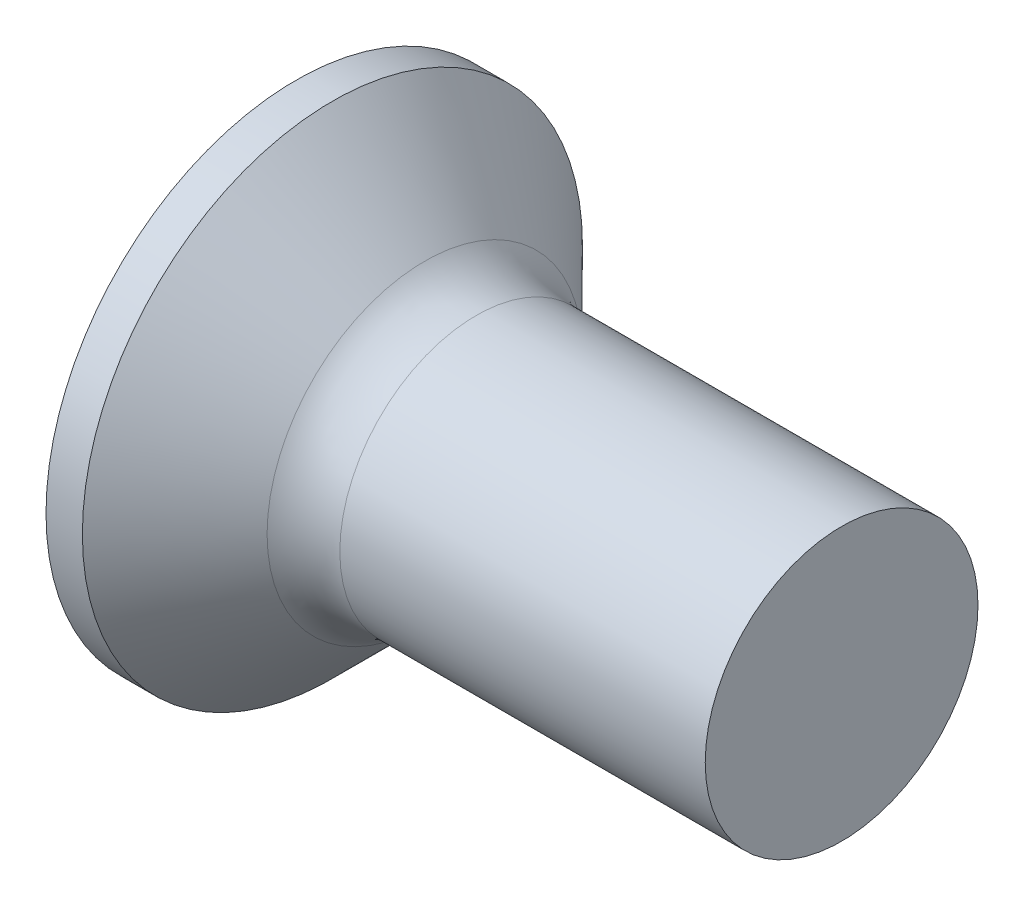
ISO-10303-21;
HEADER;
FILE_DESCRIPTION(('STEP AP214'),'2;1');
FILE_NAME('part.step','',(''),(''),'','','');
FILE_SCHEMA(('AUTOMOTIVE_DESIGN { 1 0 10303 214 1 1 1 1 }'));
ENDSEC;
DATA;
#1=APPLICATION_CONTEXT('core data for automotive mechanical design processes');
#2=APPLICATION_PROTOCOL_DEFINITION('international standard','automotive_design',2000,#1);
#3=PRODUCT_CONTEXT('',#1,'mechanical');
#4=PRODUCT('Part','Part','',(#3));
#5=PRODUCT_RELATED_PRODUCT_CATEGORY('part','',(#4));
#6=PRODUCT_DEFINITION_FORMATION('','',#4);
#7=PRODUCT_DEFINITION_CONTEXT('part definition',#1,'design');
#8=PRODUCT_DEFINITION('design','',#6,#7);
#9=PRODUCT_DEFINITION_SHAPE('','',#8);
#10=(LENGTH_UNIT() NAMED_UNIT(*) SI_UNIT(.MILLI.,.METRE.));
#11=(NAMED_UNIT(*) PLANE_ANGLE_UNIT() SI_UNIT($,.RADIAN.));
#12=(NAMED_UNIT(*) SI_UNIT($,.STERADIAN.) SOLID_ANGLE_UNIT());
#13=UNCERTAINTY_MEASURE_WITH_UNIT(LENGTH_MEASURE(1.E-05),#10,'distance_accuracy_value','');
#14=(GEOMETRIC_REPRESENTATION_CONTEXT(3) GLOBAL_UNCERTAINTY_ASSIGNED_CONTEXT((#13)) GLOBAL_UNIT_ASSIGNED_CONTEXT((#10,
#11,#12)) REPRESENTATION_CONTEXT('',''));
#15=CARTESIAN_POINT('',(0.,0.,0.));
#16=DIRECTION('',(0.,0.,1.));
#17=DIRECTION('',(1.,0.,0.));
#18=AXIS2_PLACEMENT_3D('',#15,#16,#17);
#19=CARTESIAN_POINT('',(2.01,-0.497851135403458,0.37));
#20=DIRECTION('',(0.,0.,-1.));
#21=DIRECTION('',(0.,1.,0.));
#22=AXIS2_PLACEMENT_3D('',#19,#20,#21);
#23=PLANE('',#22);
#24=DIRECTION('',(0.,-1.,0.));
#25=VECTOR('',#24,1.);
#26=CARTESIAN_POINT('',(0.,1.5,0.37));
#27=LINE('',#26,#25);
#28=CARTESIAN_POINT('',(0.,-0.590157547916263,0.37));
#29=VERTEX_POINT('',#28);
#30=CARTESIAN_POINT('',(0.,-1.5,0.37));
#31=VERTEX_POINT('',#30);
#32=EDGE_CURVE('E443',#29,#31,#27,.T.);
#33=ORIENTED_EDGE('',*,*,#32,.F.);
#34=CARTESIAN_POINT('',(-1.01053649691082,-0.672102030072118,0.37));
#35=CARTESIAN_POINT('',(-0.799706058711029,-0.655267098883948,0.37));
#36=CARTESIAN_POINT('',(-0.588886212503304,-0.638297110572312,0.37));
#37=CARTESIAN_POINT('',(-0.16727266252961,-0.603984130519828,0.37));
#38=CARTESIAN_POINT('',(0.0435210406290474,-0.586641131324258,0.37));
#39=CARTESIAN_POINT('',(0.46506883824471,-0.551479911667385,0.37));
#40=CARTESIAN_POINT('',(0.675822932715261,-0.533661691368909,0.37));
#41=CARTESIAN_POINT('',(1.09727362083221,-0.497387538872972,0.37));
#42=CARTESIAN_POINT('',(1.30797021521736,-0.47893161529909,0.37));
#43=CARTESIAN_POINT('',(1.67418894757201,-0.446067164121906,0.37));
#44=CARTESIAN_POINT('',(1.82972932585734,-0.431862501028415,0.37));
#45=CARTESIAN_POINT('',(2.14074770359484,-0.402797709739881,0.37));
#46=CARTESIAN_POINT('',(2.29622570356215,-0.387937587075171,0.37));
#47=CARTESIAN_POINT('',(2.60710169348415,-0.357305117937677,0.37));
#48=CARTESIAN_POINT('',(2.76249967840253,-0.341532719790641,0.37));
#49=CARTESIAN_POINT('',(2.99549070742189,-0.316847908281596,0.37));
#50=CARTESIAN_POINT('',(3.07313791118864,-0.308448465897183,0.37));
#51=CARTESIAN_POINT('',(3.22838341575769,-0.29120225104834,0.37));
#52=CARTESIAN_POINT('',(3.30598171599396,-0.282355473499083,0.37));
#53=CARTESIAN_POINT('',(3.38354828463398,-0.273232461289951,0.37));
#54=B_SPLINE_CURVE_WITH_KNOTS('',3,(#34,#35,#36,#37,#38,#39,#40,#41,#42,#43,#44,#45,#46,#47,#48,
#49,#50,#51,#52,#53),.UNSPECIFIED.,.F.,.F.,(4,2,2,2,2,2,2,2,2,4),(0.,0.634504777554396,
1.26902224766093,1.90353950036111,2.53804817592041,3.00661008438666,3.47516804019383,
3.94375256268972,4.17805198331267,4.41235406779909),.UNSPECIFIED.);
#55=CARTESIAN_POINT('',(2.01,-0.415013252800437,0.37));
#56=VERTEX_POINT('',#55);
#57=EDGE_CURVE('E199',#29,#56,#54,.T.);
#58=ORIENTED_EDGE('',*,*,#57,.T.);
#59=DIRECTION('',(0.,-1.,0.));
#60=VECTOR('',#59,1.);
#61=CARTESIAN_POINT('',(2.01,0.497851135403459,0.37));
#62=LINE('',#61,#60);
#63=CARTESIAN_POINT('',(2.01,-0.497851135403458,0.37));
#64=VERTEX_POINT('',#63);
#65=EDGE_CURVE('E352',#56,#64,#62,.T.);
#66=ORIENTED_EDGE('',*,*,#65,.T.);
#67=DIRECTION('',(0.894934391398442,0.446197753347436,0.));
#68=VECTOR('',#67,1.);
#69=CARTESIAN_POINT('',(0.,-1.5,0.37));
#70=LINE('',#69,#68);
#71=EDGE_CURVE('E451',#31,#64,#70,.T.);
#72=ORIENTED_EDGE('',*,*,#71,.F.);
#73=EDGE_LOOP('',(#33,#58,#66,#72));
#74=FACE_BOUND('',#73,.T.);
#75=ADVANCED_FACE('F17',(#74),#23,.T.);
#76=CARTESIAN_POINT('',(2.01,0.497851135403459,0.37));
#77=VERTEX_POINT('',#76);
#78=CARTESIAN_POINT('',(2.01,0.415013252800437,0.37));
#79=VERTEX_POINT('',#78);
#80=EDGE_CURVE('E348',#77,#79,#62,.T.);
#81=ORIENTED_EDGE('',*,*,#80,.T.);
#82=CARTESIAN_POINT('',(-1.01053649699026,0.672102030078459,0.37));
#83=CARTESIAN_POINT('',(-0.799706058781647,0.655267098889621,0.37));
#84=CARTESIAN_POINT('',(-0.588886212565098,0.63829711057731,0.37));
#85=CARTESIAN_POINT('',(-0.167272662573758,0.603984130523453,0.37));
#86=CARTESIAN_POINT('',(0.0435210405937222,0.586641131327185,0.37));
#87=CARTESIAN_POINT('',(0.465068838236453,0.551479911668094,0.37));
#88=CARTESIAN_POINT('',(0.675822932725247,0.533661691368079,0.37));
#89=CARTESIAN_POINT('',(1.09727362087867,0.497387538868944,0.37));
#90=CARTESIAN_POINT('',(1.30797021528206,0.478931615293404,0.37));
#91=CARTESIAN_POINT('',(1.67418894765493,0.446067164114376,0.37));
#92=CARTESIAN_POINT('',(1.82972932594025,0.431862501020786,0.37));
#93=CARTESIAN_POINT('',(2.14074770367773,0.402797709732016,0.37));
#94=CARTESIAN_POINT('',(2.29622570364503,0.387937587067171,0.37));
#95=CARTESIAN_POINT('',(2.607101693567,0.357305117929347,0.37));
#96=CARTESIAN_POINT('',(2.76249967848536,0.341532719782116,0.37));
#97=CARTESIAN_POINT('',(2.99549070750469,0.316847908272699,0.37));
#98=CARTESIAN_POINT('',(3.07313791127142,0.308448465888149,0.37));
#99=CARTESIAN_POINT('',(3.22838341584044,0.29120225103899,0.37));
#100=CARTESIAN_POINT('',(3.30598171607669,0.282355473489554,0.37));
#101=CARTESIAN_POINT('',(3.38354828471668,0.273232461280216,0.37));
#102=B_SPLINE_CURVE_WITH_KNOTS('',3,(#82,#83,#84,#85,#86,#87,#88,#89,#90,#91,#92,#93,#94,#95,
#96,#97,#98,#99,#100,#101),.UNSPECIFIED.,.F.,.F.,(4,2,2,2,2,2,2,2,2,4),(0.,0.634504777580944,
1.26902224771403,1.90353950046914,2.53804817608336,3.00661008454961,3.47516804035678,
3.94375256285269,4.17805198347564,4.41235406796206),.UNSPECIFIED.);
#103=CARTESIAN_POINT('',(0.,0.590157547916263,0.37));
#104=VERTEX_POINT('',#103);
#105=EDGE_CURVE('E192',#79,#104,#102,.F.);
#106=ORIENTED_EDGE('',*,*,#105,.T.);
#107=CARTESIAN_POINT('',(0.,1.5,0.37));
#108=VERTEX_POINT('',#107);
#109=EDGE_CURVE('E445',#108,#104,#27,.T.);
#110=ORIENTED_EDGE('',*,*,#109,.F.);
#111=DIRECTION('',(0.894934391398442,-0.446197753347436,0.));
#112=VECTOR('',#111,1.);
#113=CARTESIAN_POINT('',(0.,1.5,0.37));
#114=LINE('',#113,#112);
#115=EDGE_CURVE('E40',#108,#77,#114,.T.);
#116=ORIENTED_EDGE('',*,*,#115,.T.);
#117=EDGE_LOOP('',(#81,#106,#110,#116));
#118=FACE_BOUND('',#117,.T.);
#119=ADVANCED_FACE('F173',(#118),#23,.T.);
#120=CARTESIAN_POINT('',(2.01,0.497851135403458,-0.37));
#121=DIRECTION('',(0.,0.,1.));
#122=DIRECTION('',(1.,0.,0.));
#123=AXIS2_PLACEMENT_3D('',#120,#121,#122);
#124=PLANE('',#123);
#125=DIRECTION('',(0.,1.,0.));
#126=VECTOR('',#125,1.);
#127=CARTESIAN_POINT('',(2.01,-0.497851135403458,-0.37));
#128=LINE('',#127,#126);
#129=CARTESIAN_POINT('',(2.01,-0.497851135403458,-0.37));
#130=VERTEX_POINT('',#129);
#131=CARTESIAN_POINT('',(2.01,-0.415013252800437,-0.37));
#132=VERTEX_POINT('',#131);
#133=EDGE_CURVE('E361',#130,#132,#128,.T.);
#134=ORIENTED_EDGE('',*,*,#133,.T.);
#135=CARTESIAN_POINT('',(-1.01053649691082,-0.672102030072118,-0.37));
#136=CARTESIAN_POINT('',(-0.799706058711029,-0.655267098883947,-0.37));
#137=CARTESIAN_POINT('',(-0.588886212503304,-0.638297110572312,-0.37));
#138=CARTESIAN_POINT('',(-0.16727266252961,-0.603984130519828,-0.37));
#139=CARTESIAN_POINT('',(0.0435210406290476,-0.586641131324259,-0.37));
#140=CARTESIAN_POINT('',(0.465068838244709,-0.551479911667386,-0.37));
#141=CARTESIAN_POINT('',(0.675822932715261,-0.53366169136891,-0.37));
#142=CARTESIAN_POINT('',(1.09727362083221,-0.497387538872972,-0.37));
#143=CARTESIAN_POINT('',(1.30797021521736,-0.47893161529909,-0.37));
#144=CARTESIAN_POINT('',(1.67418894757201,-0.446067164121906,-0.37));
#145=CARTESIAN_POINT('',(1.82972932585734,-0.431862501028415,-0.37));
#146=CARTESIAN_POINT('',(2.14074770359484,-0.40279770973988,-0.37));
#147=CARTESIAN_POINT('',(2.29622570356215,-0.387937587075171,-0.37));
#148=CARTESIAN_POINT('',(2.60710169348415,-0.357305117937677,-0.37));
#149=CARTESIAN_POINT('',(2.76249967840254,-0.341532719790641,-0.37));
#150=CARTESIAN_POINT('',(2.9954907074219,-0.316847908281596,-0.37));
#151=CARTESIAN_POINT('',(3.07313791118864,-0.308448465897183,-0.37));
#152=CARTESIAN_POINT('',(3.2283834157577,-0.29120225104834,-0.37));
#153=CARTESIAN_POINT('',(3.30598171599396,-0.282355473499083,-0.37));
#154=CARTESIAN_POINT('',(3.38354828463398,-0.273232461289951,-0.37));
#155=B_SPLINE_CURVE_WITH_KNOTS('',3,(#135,#136,#137,#138,#139,#140,#141,#142,#143,#144,#145,
#146,#147,#148,#149,#150,#151,#152,#153,#154),.UNSPECIFIED.,.F.,.F.,(4,2,2,2,2,2,2,2,2,4),(0.,
0.634504777554396,1.26902224766093,1.90353950036111,2.53804817592041,3.00661008438666,
3.47516804019383,3.94375256268972,4.17805198331268,4.41235406779909),.UNSPECIFIED.);
#156=CARTESIAN_POINT('',(0.,-0.590157547916263,-0.37));
#157=VERTEX_POINT('',#156);
#158=EDGE_CURVE('E255',#132,#157,#155,.F.);
#159=ORIENTED_EDGE('',*,*,#158,.T.);
#160=DIRECTION('',(0.,1.,0.));
#161=VECTOR('',#160,1.);
#162=CARTESIAN_POINT('',(0.,-1.5,-0.37));
#163=LINE('',#162,#161);
#164=CARTESIAN_POINT('',(0.,-1.5,-0.37));
#165=VERTEX_POINT('',#164);
#166=EDGE_CURVE('E444',#165,#157,#163,.T.);
#167=ORIENTED_EDGE('',*,*,#166,.F.);
#168=DIRECTION('',(0.894934391398442,0.446197753347436,0.));
#169=VECTOR('',#168,1.);
#170=CARTESIAN_POINT('',(0.,-1.5,-0.37));
#171=LINE('',#170,#169);
#172=EDGE_CURVE('E454',#165,#130,#171,.T.);
#173=ORIENTED_EDGE('',*,*,#172,.T.);
#174=EDGE_LOOP('',(#134,#159,#167,#173));
#175=FACE_BOUND('',#174,.T.);
#176=ADVANCED_FACE('F180',(#175),#124,.T.);
#177=CARTESIAN_POINT('',(0.,0.590157547916263,-0.37));
#178=VERTEX_POINT('',#177);
#179=CARTESIAN_POINT('',(0.,1.5,-0.37));
#180=VERTEX_POINT('',#179);
#181=EDGE_CURVE('E450',#178,#180,#163,.T.);
#182=ORIENTED_EDGE('',*,*,#181,.F.);
#183=CARTESIAN_POINT('',(-1.01053649691082,0.672102030072118,-0.37));
#184=CARTESIAN_POINT('',(-0.799706058711029,0.655267098883947,-0.37));
#185=CARTESIAN_POINT('',(-0.588886212503304,0.638297110572312,-0.37));
#186=CARTESIAN_POINT('',(-0.16727266252961,0.603984130519828,-0.37));
#187=CARTESIAN_POINT('',(0.0435210406290476,0.586641131324259,-0.37));
#188=CARTESIAN_POINT('',(0.465068838244709,0.551479911667386,-0.37));
#189=CARTESIAN_POINT('',(0.675822932715261,0.53366169136891,-0.37));
#190=CARTESIAN_POINT('',(1.09727362083221,0.497387538872972,-0.37));
#191=CARTESIAN_POINT('',(1.30797021521736,0.47893161529909,-0.37));
#192=CARTESIAN_POINT('',(1.67418894757201,0.446067164121906,-0.37));
#193=CARTESIAN_POINT('',(1.82972932585734,0.431862501028415,-0.37));
#194=CARTESIAN_POINT('',(2.14074770359484,0.40279770973988,-0.37));
#195=CARTESIAN_POINT('',(2.29622570356215,0.387937587075171,-0.37));
#196=CARTESIAN_POINT('',(2.60710169348415,0.357305117937677,-0.37));
#197=CARTESIAN_POINT('',(2.76249967840254,0.341532719790641,-0.37));
#198=CARTESIAN_POINT('',(2.9954907074219,0.316847908281596,-0.37));
#199=CARTESIAN_POINT('',(3.07313791118864,0.308448465897183,-0.37));
#200=CARTESIAN_POINT('',(3.2283834157577,0.29120225104834,-0.37));
#201=CARTESIAN_POINT('',(3.30598171599396,0.282355473499083,-0.37));
#202=CARTESIAN_POINT('',(3.38354828463398,0.273232461289951,-0.37));
#203=B_SPLINE_CURVE_WITH_KNOTS('',3,(#183,#184,#185,#186,#187,#188,#189,#190,#191,#192,#193,
#194,#195,#196,#197,#198,#199,#200,#201,#202),.UNSPECIFIED.,.F.,.F.,(4,2,2,2,2,2,2,2,2,4),(0.,
0.634504777554396,1.26902224766093,1.90353950036111,2.53804817592041,3.00661008438666,
3.47516804019383,3.94375256268972,4.17805198331268,4.41235406779909),.UNSPECIFIED.);
#204=CARTESIAN_POINT('',(2.01,0.415013252800437,-0.37));
#205=VERTEX_POINT('',#204);
#206=EDGE_CURVE('E249',#178,#205,#203,.T.);
#207=ORIENTED_EDGE('',*,*,#206,.T.);
#208=CARTESIAN_POINT('',(2.01,0.497851135403459,-0.37));
#209=VERTEX_POINT('',#208);
#210=EDGE_CURVE('E363',#205,#209,#128,.T.);
#211=ORIENTED_EDGE('',*,*,#210,.T.);
#212=DIRECTION('',(0.894934391398442,-0.446197753347436,0.));
#213=VECTOR('',#212,1.);
#214=CARTESIAN_POINT('',(0.,1.5,-0.37));
#215=LINE('',#214,#213);
#216=EDGE_CURVE('E360',#180,#209,#215,.T.);
#217=ORIENTED_EDGE('',*,*,#216,.F.);
#218=EDGE_LOOP('',(#182,#207,#211,#217));
#219=FACE_BOUND('',#218,.T.);
#220=ADVANCED_FACE('F461',(#219),#124,.T.);
#221=CARTESIAN_POINT('',(2.01,0.497851135403459,-0.37));
#222=DIRECTION('',(1.,0.,0.));
#223=DIRECTION('',(0.,0.,-1.));
#224=AXIS2_PLACEMENT_3D('',#221,#222,#223);
#225=PLANE('',#224);
#226=CARTESIAN_POINT('',(2.01,0.,0.));
#227=DIRECTION('',(-1.,0.,0.));
#228=DIRECTION('',(0.,0.,1.));
#229=AXIS2_PLACEMENT_3D('',#226,#227,#228);
#230=CIRCLE('',#229,0.556);
#231=CARTESIAN_POINT('',(2.01,-0.247548473995471,-0.497851135403459));
#232=VERTEX_POINT('',#231);
#233=CARTESIAN_POINT('',(2.01,-0.37,-0.415013252800438));
#234=VERTEX_POINT('',#233);
#235=EDGE_CURVE('E327',#232,#234,#230,.T.);
#236=ORIENTED_EDGE('',*,*,#235,.F.);
#237=DIRECTION('',(0.,1.,0.));
#238=VECTOR('',#237,1.);
#239=CARTESIAN_POINT('',(2.01,-0.37,-0.49785113540346));
#240=LINE('',#239,#238);
#241=CARTESIAN_POINT('',(2.01,-0.37,-0.49785113540346));
#242=VERTEX_POINT('',#241);
#243=EDGE_CURVE('E428',#242,#232,#240,.T.);
#244=ORIENTED_EDGE('',*,*,#243,.F.);
#245=DIRECTION('',(0.,0.,-1.));
#246=VECTOR('',#245,1.);
#247=CARTESIAN_POINT('',(2.01,-0.37,0.497851135403457));
#248=LINE('',#247,#246);
#249=EDGE_CURVE('E432',#234,#242,#248,.T.);
#250=ORIENTED_EDGE('',*,*,#249,.F.);
#251=EDGE_LOOP('',(#236,#244,#250));
#252=FACE_BOUND('',#251,.T.);
#253=ADVANCED_FACE('F475',(#252),#225,.F.);
#254=CARTESIAN_POINT('',(2.01,-0.497851135403458,-0.247548473995472));
#255=VERTEX_POINT('',#254);
#256=EDGE_CURVE('E322',#132,#255,#230,.T.);
#257=ORIENTED_EDGE('',*,*,#256,.F.);
#258=ORIENTED_EDGE('',*,*,#133,.F.);
#259=DIRECTION('',(0.,0.,-1.));
#260=VECTOR('',#259,1.);
#261=CARTESIAN_POINT('',(2.01,-0.497851135403458,0.37));
#262=LINE('',#261,#260);
#263=EDGE_CURVE('E351',#255,#130,#262,.T.);
#264=ORIENTED_EDGE('',*,*,#263,.F.);
#265=EDGE_LOOP('',(#257,#258,#264));
#266=FACE_BOUND('',#265,.T.);
#267=ADVANCED_FACE('F482',(#266),#225,.F.);
#268=CARTESIAN_POINT('',(2.01,-0.497851135403458,0.247548473995472));
#269=VERTEX_POINT('',#268);
#270=EDGE_CURVE('E317',#269,#56,#230,.T.);
#271=ORIENTED_EDGE('',*,*,#270,.F.);
#272=EDGE_CURVE('E354',#64,#269,#262,.T.);
#273=ORIENTED_EDGE('',*,*,#272,.F.);
#274=ORIENTED_EDGE('',*,*,#65,.F.);
#275=EDGE_LOOP('',(#271,#273,#274));
#276=FACE_BOUND('',#275,.T.);
#277=ADVANCED_FACE('F489',(#276),#225,.F.);
#278=CARTESIAN_POINT('',(2.01,-0.37,0.415013252800436));
#279=VERTEX_POINT('',#278);
#280=CARTESIAN_POINT('',(2.01,-0.247548473995474,0.497851135403458));
#281=VERTEX_POINT('',#280);
#282=EDGE_CURVE('E32',#279,#281,#230,.T.);
#283=ORIENTED_EDGE('',*,*,#282,.F.);
#284=CARTESIAN_POINT('',(2.01,-0.37,0.497851135403457));
#285=VERTEX_POINT('',#284);
#286=EDGE_CURVE('E434',#285,#279,#248,.T.);
#287=ORIENTED_EDGE('',*,*,#286,.F.);
#288=DIRECTION('',(0.,-1.,0.));
#289=VECTOR('',#288,1.);
#290=CARTESIAN_POINT('',(2.01,0.37,0.49785113540346));
#291=LINE('',#290,#289);
#292=EDGE_CURVE('E433',#281,#285,#291,.T.);
#293=ORIENTED_EDGE('',*,*,#292,.F.);
#294=EDGE_LOOP('',(#283,#287,#293));
#295=FACE_BOUND('',#294,.T.);
#296=ADVANCED_FACE('F518',(#295),#225,.F.);
#297=CARTESIAN_POINT('',(2.01,0.24754847399547,0.497851135403459));
#298=VERTEX_POINT('',#297);
#299=CARTESIAN_POINT('',(2.01,0.37,0.415013252800438));
#300=VERTEX_POINT('',#299);
#301=EDGE_CURVE('E308',#298,#300,#230,.T.);
#302=ORIENTED_EDGE('',*,*,#301,.F.);
#303=CARTESIAN_POINT('',(2.01,0.37,0.49785113540346));
#304=VERTEX_POINT('',#303);
#305=EDGE_CURVE('E429',#304,#298,#291,.T.);
#306=ORIENTED_EDGE('',*,*,#305,.F.);
#307=DIRECTION('',(0.,0.,1.));
#308=VECTOR('',#307,1.);
#309=CARTESIAN_POINT('',(2.01,0.37,-0.497851135403457));
#310=LINE('',#309,#308);
#311=EDGE_CURVE('E206',#300,#304,#310,.T.);
#312=ORIENTED_EDGE('',*,*,#311,.F.);
#313=EDGE_LOOP('',(#302,#306,#312));
#314=FACE_BOUND('',#313,.T.);
#315=ADVANCED_FACE('F471',(#314),#225,.F.);
#316=CARTESIAN_POINT('',(2.01,0.497851135403459,0.247548473995472));
#317=VERTEX_POINT('',#316);
#318=EDGE_CURVE('E315',#79,#317,#230,.T.);
#319=ORIENTED_EDGE('',*,*,#318,.F.);
#320=ORIENTED_EDGE('',*,*,#80,.F.);
#321=DIRECTION('',(0.,0.,1.));
#322=VECTOR('',#321,1.);
#323=CARTESIAN_POINT('',(2.01,0.497851135403459,-0.37));
#324=LINE('',#323,#322);
#325=EDGE_CURVE('E349',#317,#77,#324,.T.);
#326=ORIENTED_EDGE('',*,*,#325,.F.);
#327=EDGE_LOOP('',(#319,#320,#326));
#328=FACE_BOUND('',#327,.T.);
#329=ADVANCED_FACE('F347',(#328),#225,.F.);
#330=CARTESIAN_POINT('',(2.01,0.497851135403459,-0.247548473995472));
#331=VERTEX_POINT('',#330);
#332=EDGE_CURVE('E337',#331,#205,#230,.T.);
#333=ORIENTED_EDGE('',*,*,#332,.F.);
#334=EDGE_CURVE('E356',#209,#331,#324,.T.);
#335=ORIENTED_EDGE('',*,*,#334,.F.);
#336=ORIENTED_EDGE('',*,*,#210,.F.);
#337=EDGE_LOOP('',(#333,#335,#336));
#338=FACE_BOUND('',#337,.T.);
#339=ADVANCED_FACE('F463',(#338),#225,.F.);
#340=CARTESIAN_POINT('',(2.01,-0.497851135403458,-0.37));
#341=DIRECTION('',(-0.446197753347436,0.894934391398443,0.));
#342=DIRECTION('',(-0.894934391398442,-0.446197753347436,0.));
#343=AXIS2_PLACEMENT_3D('',#340,#341,#342);
#344=PLANE('',#343);
#345=ORIENTED_EDGE('',*,*,#272,.T.);
#346=CARTESIAN_POINT('',(2.86902919914418,-0.0695550475538963,0.));
#347=DIRECTION('',(-0.446197753347436,0.894934391398443,0.));
#348=DIRECTION('',(-0.894934391398443,-0.446197753347436,0.));
#349=AXIS2_PLACEMENT_3D('',#346,#347,#348);
#350=ELLIPSE('',#349,1.11145971268776,0.491029001453358);
#351=EDGE_CURVE('E267',#269,#255,#350,.F.);
#352=ORIENTED_EDGE('',*,*,#351,.T.);
#353=ORIENTED_EDGE('',*,*,#263,.T.);
#354=ORIENTED_EDGE('',*,*,#172,.F.);
#355=DIRECTION('',(0.,0.,-1.));
#356=VECTOR('',#355,1.);
#357=CARTESIAN_POINT('',(0.,-1.5,0.37));
#358=LINE('',#357,#356);
#359=EDGE_CURVE('E368',#31,#165,#358,.T.);
#360=ORIENTED_EDGE('',*,*,#359,.F.);
#361=ORIENTED_EDGE('',*,*,#71,.T.);
#362=EDGE_LOOP('',(#345,#352,#353,#354,#360,#361));
#363=FACE_BOUND('',#362,.T.);
#364=ADVANCED_FACE('F186',(#363),#344,.T.);
#365=CARTESIAN_POINT('',(2.01,0.497851135403459,0.37));
#366=DIRECTION('',(-0.446197753347436,-0.894934391398443,0.));
#367=DIRECTION('',(0.894934391398442,-0.446197753347436,0.));
#368=AXIS2_PLACEMENT_3D('',#365,#366,#367);
#369=PLANE('',#368);
#370=ORIENTED_EDGE('',*,*,#334,.T.);
#371=CARTESIAN_POINT('',(2.86902919914418,0.0695550475538964,0.));
#372=DIRECTION('',(-0.446197753347436,-0.894934391398443,0.));
#373=DIRECTION('',(-0.894934391398443,0.446197753347436,0.));
#374=AXIS2_PLACEMENT_3D('',#371,#372,#373);
#375=ELLIPSE('',#374,1.11145971268776,0.491029001453358);
#376=EDGE_CURVE('E272',#331,#317,#375,.F.);
#377=ORIENTED_EDGE('',*,*,#376,.T.);
#378=ORIENTED_EDGE('',*,*,#325,.T.);
#379=ORIENTED_EDGE('',*,*,#115,.F.);
#380=DIRECTION('',(0.,0.,1.));
#381=VECTOR('',#380,1.);
#382=CARTESIAN_POINT('',(0.,1.5,-0.37));
#383=LINE('',#382,#381);
#384=EDGE_CURVE('E440',#180,#108,#383,.T.);
#385=ORIENTED_EDGE('',*,*,#384,.F.);
#386=ORIENTED_EDGE('',*,*,#216,.T.);
#387=EDGE_LOOP('',(#370,#377,#378,#379,#385,#386));
#388=FACE_BOUND('',#387,.T.);
#389=ADVANCED_FACE('F459',(#388),#369,.T.);
#390=CARTESIAN_POINT('',(2.01,0.37,0.49785113540346));
#391=DIRECTION('',(0.,-1.,0.));
#392=DIRECTION('',(1.,0.,0.));
#393=AXIS2_PLACEMENT_3D('',#390,#391,#392);
#394=PLANE('',#393);
#395=CARTESIAN_POINT('',(2.01,0.37,-0.497851135403457));
#396=VERTEX_POINT('',#395);
#397=CARTESIAN_POINT('',(2.01,0.37,-0.415013252800436));
#398=VERTEX_POINT('',#397);
#399=EDGE_CURVE('E438',#396,#398,#310,.T.);
#400=ORIENTED_EDGE('',*,*,#399,.T.);
#401=CARTESIAN_POINT('',(-1.01053649699026,0.37,-0.672102030078458));
#402=CARTESIAN_POINT('',(-0.799706058781647,0.370000000000005,-0.655267098889618));
#403=CARTESIAN_POINT('',(-0.588886212565098,0.370000000000005,-0.638297110577307));
#404=CARTESIAN_POINT('',(-0.167272662573759,0.370000000000002,-0.603984130523451));
#405=CARTESIAN_POINT('',(0.0435210405937217,0.37,-0.586641131327184));
#406=CARTESIAN_POINT('',(0.465068838236452,0.37,-0.551479911668093));
#407=CARTESIAN_POINT('',(0.675822932725247,0.370000000000004,-0.533661691368076));
#408=CARTESIAN_POINT('',(1.09727362087867,0.370000000000003,-0.497387538868941));
#409=CARTESIAN_POINT('',(1.30797021528206,0.37,-0.478931615293403));
#410=CARTESIAN_POINT('',(1.67418894765493,0.37,-0.446067164114375));
#411=CARTESIAN_POINT('',(1.82972932594025,0.370000000000002,-0.431862501020783));
#412=CARTESIAN_POINT('',(2.14074770367772,0.370000000000004,-0.402797709732013));
#413=CARTESIAN_POINT('',(2.29622570364503,0.370000000000003,-0.387937587067168));
#414=CARTESIAN_POINT('',(2.607101693567,0.370000000000003,-0.357305117929344));
#415=CARTESIAN_POINT('',(2.76249967848536,0.370000000000003,-0.341532719782113));
#416=CARTESIAN_POINT('',(2.99549070750469,0.370000000000003,-0.316847908272695));
#417=CARTESIAN_POINT('',(3.07313791127142,0.370000000000003,-0.308448465888145));
#418=CARTESIAN_POINT('',(3.22838341584044,0.370000000000003,-0.291202251038987));
#419=CARTESIAN_POINT('',(3.30598171607669,0.370000000000002,-0.282355473489552));
#420=CARTESIAN_POINT('',(3.38354828471668,0.37,-0.273232461280215));
#421=B_SPLINE_CURVE_WITH_KNOTS('',3,(#401,#402,#403,#404,#405,#406,#407,#408,#409,#410,#411,
#412,#413,#414,#415,#416,#417,#418,#419,#420),.UNSPECIFIED.,.F.,.F.,(4,2,2,2,2,2,2,2,2,4),(0.,
0.634504777580944,1.26902224771403,1.90353950046914,2.53804817608336,3.00661008454961,
3.47516804035678,3.94375256285269,4.17805198347564,4.41235406796206),.UNSPECIFIED.);
#422=CARTESIAN_POINT('',(0.,0.37,-0.590157547916262));
#423=VERTEX_POINT('',#422);
#424=EDGE_CURVE('E241',#398,#423,#421,.F.);
#425=ORIENTED_EDGE('',*,*,#424,.T.);
#426=DIRECTION('',(0.,0.,1.));
#427=VECTOR('',#426,1.);
#428=CARTESIAN_POINT('',(0.,0.370000000000005,-1.5));
#429=LINE('',#428,#427);
#430=CARTESIAN_POINT('',(0.,0.370000000000005,-1.5));
#431=VERTEX_POINT('',#430);
#432=EDGE_CURVE('E414',#431,#423,#429,.T.);
#433=ORIENTED_EDGE('',*,*,#432,.F.);
#434=DIRECTION('',(0.894934391398442,0.,0.446197753347436));
#435=VECTOR('',#434,1.);
#436=CARTESIAN_POINT('',(0.,0.370000000000005,-1.5));
#437=LINE('',#436,#435);
#438=EDGE_CURVE('E420',#431,#396,#437,.T.);
#439=ORIENTED_EDGE('',*,*,#438,.T.);
#440=EDGE_LOOP('',(#400,#425,#433,#439));
#441=FACE_BOUND('',#440,.T.);
#442=ADVANCED_FACE('F598',(#441),#394,.T.);
#443=CARTESIAN_POINT('',(2.01,-0.37,-0.497851135403459));
#444=DIRECTION('',(0.,1.,0.));
#445=DIRECTION('',(0.,0.,1.));
#446=AXIS2_PLACEMENT_3D('',#443,#444,#445);
#447=PLANE('',#446);
#448=DIRECTION('',(0.,0.,-1.));
#449=VECTOR('',#448,1.);
#450=CARTESIAN_POINT('',(0.,-0.370000000000005,1.5));
#451=LINE('',#450,#449);
#452=CARTESIAN_POINT('',(0.,-0.37,-0.590157547916264));
#453=VERTEX_POINT('',#452);
#454=CARTESIAN_POINT('',(0.,-0.369999999999995,-1.5));
#455=VERTEX_POINT('',#454);
#456=EDGE_CURVE('E410',#453,#455,#451,.T.);
#457=ORIENTED_EDGE('',*,*,#456,.F.);
#458=CARTESIAN_POINT('',(-1.01053649699026,-0.37,-0.67210203007846));
#459=CARTESIAN_POINT('',(-0.799706058781647,-0.369999999999999,-0.655267098889621));
#460=CARTESIAN_POINT('',(-0.588886212565098,-0.369999999999999,-0.63829711057731));
#461=CARTESIAN_POINT('',(-0.167272662573758,-0.37,-0.603984130523453));
#462=CARTESIAN_POINT('',(0.0435210405937221,-0.37,-0.586641131327186));
#463=CARTESIAN_POINT('',(0.465068838236453,-0.37,-0.551479911668095));
#464=CARTESIAN_POINT('',(0.675822932725247,-0.37,-0.533661691368079));
#465=CARTESIAN_POINT('',(1.09727362087867,-0.37,-0.497387538868944));
#466=CARTESIAN_POINT('',(1.30797021528206,-0.37,-0.478931615293406));
#467=CARTESIAN_POINT('',(1.67418894765493,-0.37,-0.446067164114378));
#468=CARTESIAN_POINT('',(1.82972932594025,-0.37,-0.431862501020786));
#469=CARTESIAN_POINT('',(2.14074770367772,-0.37,-0.402797709732016));
#470=CARTESIAN_POINT('',(2.29622570364503,-0.37,-0.38793758706717));
#471=CARTESIAN_POINT('',(2.60710169356699,-0.37,-0.357305117929347));
#472=CARTESIAN_POINT('',(2.76249967848536,-0.37,-0.341532719782116));
#473=CARTESIAN_POINT('',(2.99549070750469,-0.370000000000001,-0.316847908272698));
#474=CARTESIAN_POINT('',(3.07313791127142,-0.370000000000001,-0.308448465888148));
#475=CARTESIAN_POINT('',(3.22838341584044,-0.370000000000001,-0.291202251038989));
#476=CARTESIAN_POINT('',(3.30598171607669,-0.37,-0.282355473489554));
#477=CARTESIAN_POINT('',(3.38354828471668,-0.37,-0.273232461280217));
#478=B_SPLINE_CURVE_WITH_KNOTS('',3,(#458,#459,#460,#461,#462,#463,#464,#465,#466,#467,#468,
#469,#470,#471,#472,#473,#474,#475,#476,#477),.UNSPECIFIED.,.F.,.F.,(4,2,2,2,2,2,2,2,2,4),(0.,
0.634504777580944,1.26902224771403,1.90353950046914,2.53804817608336,3.00661008454961,
3.47516804035678,3.94375256285268,4.17805198347564,4.41235406796206),.UNSPECIFIED.);
#479=EDGE_CURVE('E234',#453,#234,#478,.T.);
#480=ORIENTED_EDGE('',*,*,#479,.T.);
#481=ORIENTED_EDGE('',*,*,#249,.T.);
#482=DIRECTION('',(0.894934391398442,0.,0.446197753347436));
#483=VECTOR('',#482,1.);
#484=CARTESIAN_POINT('',(0.,-0.369999999999995,-1.5));
#485=LINE('',#484,#483);
#486=EDGE_CURVE('E417',#455,#242,#485,.T.);
#487=ORIENTED_EDGE('',*,*,#486,.F.);
#488=EDGE_LOOP('',(#457,#480,#481,#487));
#489=FACE_BOUND('',#488,.T.);
#490=ADVANCED_FACE('F494',(#489),#447,.T.);
#491=CARTESIAN_POINT('',(2.01,0.37,-0.497851135403457));
#492=DIRECTION('',(-0.446197753347436,0.,0.894934391398443));
#493=DIRECTION('',(-0.894934391398442,0.,-0.446197753347436));
#494=AXIS2_PLACEMENT_3D('',#491,#492,#493);
#495=PLANE('',#494);
#496=ORIENTED_EDGE('',*,*,#243,.T.);
#497=CARTESIAN_POINT('',(2.86902919914418,0.,-0.0695550475538964));
#498=DIRECTION('',(-0.446197753347436,0.,0.894934391398443));
#499=DIRECTION('',(-0.894934391398443,0.,-0.446197753347436));
#500=AXIS2_PLACEMENT_3D('',#497,#498,#499);
#501=ELLIPSE('',#500,1.11145971268776,0.491029001453358);
#502=CARTESIAN_POINT('',(2.01,0.247548473995474,-0.497851135403457));
#503=VERTEX_POINT('',#502);
#504=EDGE_CURVE('E285',#232,#503,#501,.F.);
#505=ORIENTED_EDGE('',*,*,#504,.T.);
#506=EDGE_CURVE('E436',#503,#396,#240,.T.);
#507=ORIENTED_EDGE('',*,*,#506,.T.);
#508=ORIENTED_EDGE('',*,*,#438,.F.);
#509=DIRECTION('',(0.,1.,0.));
#510=VECTOR('',#509,1.);
#511=CARTESIAN_POINT('',(0.,-0.369999999999995,-1.5));
#512=LINE('',#511,#510);
#513=EDGE_CURVE('E409',#455,#431,#512,.T.);
#514=ORIENTED_EDGE('',*,*,#513,.F.);
#515=ORIENTED_EDGE('',*,*,#486,.T.);
#516=EDGE_LOOP('',(#496,#505,#507,#508,#514,#515));
#517=FACE_BOUND('',#516,.T.);
#518=ADVANCED_FACE('F211',(#517),#495,.T.);
#519=ORIENTED_EDGE('',*,*,#286,.T.);
#520=CARTESIAN_POINT('',(-1.01053649699026,-0.37,0.672102030078458));
#521=CARTESIAN_POINT('',(-0.799706058781647,-0.370000000000005,0.655267098889618));
#522=CARTESIAN_POINT('',(-0.588886212565098,-0.370000000000005,0.638297110577307));
#523=CARTESIAN_POINT('',(-0.167272662573759,-0.370000000000002,0.603984130523451));
#524=CARTESIAN_POINT('',(0.0435210405937217,-0.37,0.586641131327184));
#525=CARTESIAN_POINT('',(0.465068838236452,-0.37,0.551479911668093));
#526=CARTESIAN_POINT('',(0.675822932725247,-0.370000000000003,0.533661691368076));
#527=CARTESIAN_POINT('',(1.09727362087867,-0.370000000000003,0.497387538868941));
#528=CARTESIAN_POINT('',(1.30797021528206,-0.37,0.478931615293403));
#529=CARTESIAN_POINT('',(1.67418894765493,-0.37,0.446067164114375));
#530=CARTESIAN_POINT('',(1.82972932594025,-0.370000000000002,0.431862501020783));
#531=CARTESIAN_POINT('',(2.14074770367772,-0.370000000000004,0.402797709732013));
#532=CARTESIAN_POINT('',(2.29622570364503,-0.370000000000003,0.387937587067168));
#533=CARTESIAN_POINT('',(2.607101693567,-0.370000000000003,0.357305117929344));
#534=CARTESIAN_POINT('',(2.76249967848536,-0.370000000000003,0.341532719782113));
#535=CARTESIAN_POINT('',(2.99549070750469,-0.370000000000003,0.316847908272696));
#536=CARTESIAN_POINT('',(3.07313791127142,-0.370000000000003,0.308448465888146));
#537=CARTESIAN_POINT('',(3.22838341584044,-0.370000000000002,0.291202251038987));
#538=CARTESIAN_POINT('',(3.30598171607669,-0.370000000000002,0.282355473489552));
#539=CARTESIAN_POINT('',(3.38354828471668,-0.37,0.273232461280215));
#540=B_SPLINE_CURVE_WITH_KNOTS('',3,(#520,#521,#522,#523,#524,#525,#526,#527,#528,#529,#530,
#531,#532,#533,#534,#535,#536,#537,#538,#539),.UNSPECIFIED.,.F.,.F.,(4,2,2,2,2,2,2,2,2,4),(0.,
0.634504777580944,1.26902224771403,1.90353950046914,2.53804817608336,3.00661008454961,
3.47516804035678,3.94375256285269,4.17805198347564,4.41235406796206),.UNSPECIFIED.);
#541=CARTESIAN_POINT('',(0.,-0.37,0.590157547916262));
#542=VERTEX_POINT('',#541);
#543=EDGE_CURVE('E226',#279,#542,#540,.F.);
#544=ORIENTED_EDGE('',*,*,#543,.T.);
#545=CARTESIAN_POINT('',(0.,-0.370000000000005,1.5));
#546=VERTEX_POINT('',#545);
#547=EDGE_CURVE('E405',#546,#542,#451,.T.);
#548=ORIENTED_EDGE('',*,*,#547,.F.);
#549=DIRECTION('',(0.894934391398442,0.,-0.446197753347436));
#550=VECTOR('',#549,1.);
#551=CARTESIAN_POINT('',(0.,-0.370000000000005,1.5));
#552=LINE('',#551,#550);
#553=EDGE_CURVE('E423',#546,#285,#552,.T.);
#554=ORIENTED_EDGE('',*,*,#553,.T.);
#555=EDGE_LOOP('',(#519,#544,#548,#554));
#556=FACE_BOUND('',#555,.T.);
#557=ADVANCED_FACE('F516',(#556),#447,.T.);
#558=CARTESIAN_POINT('',(0.,0.37,0.590157547916264));
#559=VERTEX_POINT('',#558);
#560=CARTESIAN_POINT('',(0.,0.369999999999994,1.5));
#561=VERTEX_POINT('',#560);
#562=EDGE_CURVE('E416',#559,#561,#429,.T.);
#563=ORIENTED_EDGE('',*,*,#562,.F.);
#564=CARTESIAN_POINT('',(-1.01053649699026,0.37,0.67210203007846));
#565=CARTESIAN_POINT('',(-0.799706058781647,0.369999999999999,0.65526709888962));
#566=CARTESIAN_POINT('',(-0.588886212565098,0.369999999999999,0.63829711057731));
#567=CARTESIAN_POINT('',(-0.167272662573758,0.37,0.603984130523454));
#568=CARTESIAN_POINT('',(0.0435210405937222,0.37,0.586641131327187));
#569=CARTESIAN_POINT('',(0.465068838236453,0.37,0.551479911668096));
#570=CARTESIAN_POINT('',(0.675822932725248,0.37,0.533661691368079));
#571=CARTESIAN_POINT('',(1.09727362087867,0.37,0.497387538868944));
#572=CARTESIAN_POINT('',(1.30797021528206,0.37,0.478931615293406));
#573=CARTESIAN_POINT('',(1.67418894765493,0.37,0.446067164114378));
#574=CARTESIAN_POINT('',(1.82972932594025,0.37,0.431862501020786));
#575=CARTESIAN_POINT('',(2.14074770367772,0.37,0.402797709732015));
#576=CARTESIAN_POINT('',(2.29622570364503,0.37,0.38793758706717));
#577=CARTESIAN_POINT('',(2.60710169356699,0.370000000000001,0.357305117929347));
#578=CARTESIAN_POINT('',(2.76249967848536,0.370000000000001,0.341532719782116));
#579=CARTESIAN_POINT('',(2.99549070750469,0.370000000000001,0.316847908272698));
#580=CARTESIAN_POINT('',(3.07313791127142,0.370000000000001,0.308448465888148));
#581=CARTESIAN_POINT('',(3.22838341584044,0.370000000000001,0.291202251038989));
#582=CARTESIAN_POINT('',(3.30598171607669,0.370000000000001,0.282355473489554));
#583=CARTESIAN_POINT('',(3.38354828471668,0.37,0.273232461280217));
#584=B_SPLINE_CURVE_WITH_KNOTS('',3,(#564,#565,#566,#567,#568,#569,#570,#571,#572,#573,#574,
#575,#576,#577,#578,#579,#580,#581,#582,#583),.UNSPECIFIED.,.F.,.F.,(4,2,2,2,2,2,2,2,2,4),(0.,
0.634504777580944,1.26902224771403,1.90353950046914,2.53804817608336,3.00661008454961,
3.47516804035678,3.94375256285268,4.17805198347564,4.41235406796206),.UNSPECIFIED.);
#585=EDGE_CURVE('E216',#559,#300,#584,.T.);
#586=ORIENTED_EDGE('',*,*,#585,.T.);
#587=ORIENTED_EDGE('',*,*,#311,.T.);
#588=DIRECTION('',(0.894934391398442,0.,-0.446197753347436));
#589=VECTOR('',#588,1.);
#590=CARTESIAN_POINT('',(0.,0.369999999999994,1.5));
#591=LINE('',#590,#589);
#592=EDGE_CURVE('E425',#561,#304,#591,.T.);
#593=ORIENTED_EDGE('',*,*,#592,.F.);
#594=EDGE_LOOP('',(#563,#586,#587,#593));
#595=FACE_BOUND('',#594,.T.);
#596=ADVANCED_FACE('F511',(#595),#394,.T.);
#597=CARTESIAN_POINT('',(2.01,-0.37,0.497851135403457));
#598=DIRECTION('',(-0.446197753347436,0.,-0.894934391398443));
#599=DIRECTION('',(0.894934391398442,0.,-0.446197753347436));
#600=AXIS2_PLACEMENT_3D('',#597,#598,#599);
#601=PLANE('',#600);
#602=ORIENTED_EDGE('',*,*,#305,.T.);
#603=CARTESIAN_POINT('',(2.86902919914418,0.,0.0695550475538964));
#604=DIRECTION('',(-0.446197753347436,0.,-0.894934391398443));
#605=DIRECTION('',(-0.894934391398443,0.,0.446197753347436));
#606=AXIS2_PLACEMENT_3D('',#603,#604,#605);
#607=ELLIPSE('',#606,1.11145971268776,0.491029001453358);
#608=EDGE_CURVE('E11',#298,#281,#607,.F.);
#609=ORIENTED_EDGE('',*,*,#608,.T.);
#610=ORIENTED_EDGE('',*,*,#292,.T.);
#611=ORIENTED_EDGE('',*,*,#553,.F.);
#612=DIRECTION('',(0.,-1.,0.));
#613=VECTOR('',#612,1.);
#614=CARTESIAN_POINT('',(0.,0.369999999999994,1.5));
#615=LINE('',#614,#613);
#616=EDGE_CURVE('E207',#561,#546,#615,.T.);
#617=ORIENTED_EDGE('',*,*,#616,.F.);
#618=ORIENTED_EDGE('',*,*,#592,.T.);
#619=EDGE_LOOP('',(#602,#609,#610,#611,#617,#618));
#620=FACE_BOUND('',#619,.T.);
#621=ADVANCED_FACE('F403',(#620),#601,.T.);
#622=CARTESIAN_POINT('',(0.,0.,0.));
#623=DIRECTION('',(-1.,0.,0.));
#624=DIRECTION('',(0.,0.,1.));
#625=AXIS2_PLACEMENT_3D('',#622,#623,#624);
#626=PLANE('',#625);
#627=CARTESIAN_POINT('',(0.,0.,0.));
#628=DIRECTION('',(-1.,0.,0.));
#629=DIRECTION('',(0.,0.,1.));
#630=AXIS2_PLACEMENT_3D('',#627,#628,#629);
#631=CIRCLE('',#630,2.75);
#632=CARTESIAN_POINT('',(0.,0.,2.75));
#633=VERTEX_POINT('',#632);
#634=EDGE_CURVE('E371',#633,#633,#631,.T.);
#635=ORIENTED_EDGE('',*,*,#634,.T.);
#636=EDGE_LOOP('',(#635));
#637=FACE_BOUND('',#636,.T.);
#638=ORIENTED_EDGE('',*,*,#547,.T.);
#639=CARTESIAN_POINT('',(0.,0.,0.));
#640=DIRECTION('',(-1.,0.,0.));
#641=DIRECTION('',(0.,0.,1.));
#642=AXIS2_PLACEMENT_3D('',#639,#640,#641);
#643=CIRCLE('',#642,0.696552892006441);
#644=EDGE_CURVE('E303',#29,#542,#643,.T.);
#645=ORIENTED_EDGE('',*,*,#644,.F.);
#646=ORIENTED_EDGE('',*,*,#32,.T.);
#647=ORIENTED_EDGE('',*,*,#359,.T.);
#648=ORIENTED_EDGE('',*,*,#166,.T.);
#649=EDGE_CURVE('E306',#453,#157,#643,.T.);
#650=ORIENTED_EDGE('',*,*,#649,.F.);
#651=ORIENTED_EDGE('',*,*,#456,.T.);
#652=ORIENTED_EDGE('',*,*,#513,.T.);
#653=ORIENTED_EDGE('',*,*,#432,.T.);
#654=EDGE_CURVE('E302',#178,#423,#643,.T.);
#655=ORIENTED_EDGE('',*,*,#654,.F.);
#656=ORIENTED_EDGE('',*,*,#181,.T.);
#657=ORIENTED_EDGE('',*,*,#384,.T.);
#658=ORIENTED_EDGE('',*,*,#109,.T.);
#659=EDGE_CURVE('E298',#559,#104,#643,.T.);
#660=ORIENTED_EDGE('',*,*,#659,.F.);
#661=ORIENTED_EDGE('',*,*,#562,.T.);
#662=ORIENTED_EDGE('',*,*,#616,.T.);
#663=EDGE_LOOP('',(#638,#645,#646,#647,#648,#650,#651,#652,#653,#655,#656,#657,#658,#660,#661,#662));
#664=FACE_BOUND('',#663,.T.);
#665=ADVANCED_FACE('F397',(#637,#664),#626,.T.);
#666=CARTESIAN_POINT('',(-6.35,0.,0.));
#667=DIRECTION('',(-1.,0.,0.));
#668=DIRECTION('',(0.,0.,1.));
#669=AXIS2_PLACEMENT_3D('',#666,#667,#668);
#670=CYLINDRICAL_SURFACE('',#669,2.75);
#671=CARTESIAN_POINT('',(0.400000000000006,0.,0.));
#672=DIRECTION('',(-1.,0.,0.));
#673=DIRECTION('',(0.,0.,1.));
#674=AXIS2_PLACEMENT_3D('',#671,#672,#673);
#675=CIRCLE('',#674,2.75);
#676=CARTESIAN_POINT('',(0.400000000000006,0.,2.75));
#677=VERTEX_POINT('',#676);
#678=EDGE_CURVE('E367',#677,#677,#675,.T.);
#679=ORIENTED_EDGE('',*,*,#678,.T.);
#680=EDGE_LOOP('',(#679));
#681=FACE_BOUND('',#680,.T.);
#682=ORIENTED_EDGE('',*,*,#634,.F.);
#683=EDGE_LOOP('',(#682));
#684=FACE_BOUND('',#683,.T.);
#685=ADVANCED_FACE('F391',(#681,#684),#670,.T.);
#686=CARTESIAN_POINT('',(0.400000000000006,0.,0.));
#687=DIRECTION('',(-1.,0.,0.));
#688=DIRECTION('',(0.,0.,1.));
#689=AXIS2_PLACEMENT_3D('',#686,#687,#688);
#690=CONICAL_SURFACE('',#689,2.75,0.78539816339745);
#691=CARTESIAN_POINT('',(1.41568542494924,0.,0.));
#692=DIRECTION('',(-1.,0.,0.));
#693=DIRECTION('',(0.,0.,1.));
#694=AXIS2_PLACEMENT_3D('',#691,#692,#693);
#695=CIRCLE('',#694,1.73431457505076);
#696=CARTESIAN_POINT('',(1.41568542494924,0.,1.73431457505076));
#697=VERTEX_POINT('',#696);
#698=EDGE_CURVE('E374',#697,#697,#695,.T.);
#699=ORIENTED_EDGE('',*,*,#698,.T.);
#700=EDGE_LOOP('',(#699));
#701=FACE_BOUND('',#700,.T.);
#702=ORIENTED_EDGE('',*,*,#678,.F.);
#703=EDGE_LOOP('',(#702));
#704=FACE_BOUND('',#703,.T.);
#705=ADVANCED_FACE('F388',(#701,#704),#690,.T.);
#706=CARTESIAN_POINT('',(-6.35,0.,0.));
#707=DIRECTION('',(-1.,0.,0.));
#708=DIRECTION('',(0.,0.,1.));
#709=AXIS2_PLACEMENT_3D('',#706,#707,#708);
#710=CYLINDRICAL_SURFACE('',#709,1.5);
#711=CARTESIAN_POINT('',(1.98137084989848,0.,0.));
#712=DIRECTION('',(-1.,0.,0.));
#713=DIRECTION('',(0.,0.,1.));
#714=AXIS2_PLACEMENT_3D('',#711,#712,#713);
#715=CIRCLE('',#714,1.5);
#716=CARTESIAN_POINT('',(1.98137084989848,0.,1.5));
#717=VERTEX_POINT('',#716);
#718=EDGE_CURVE('E25',#717,#717,#715,.F.);
#719=ORIENTED_EDGE('',*,*,#718,.T.);
#720=EDGE_LOOP('',(#719));
#721=FACE_BOUND('',#720,.T.);
#722=CARTESIAN_POINT('',(6.,0.,0.));
#723=DIRECTION('',(-1.,0.,0.));
#724=DIRECTION('',(0.,0.,1.));
#725=AXIS2_PLACEMENT_3D('',#722,#723,#724);
#726=CIRCLE('',#725,1.5);
#727=CARTESIAN_POINT('',(6.,0.,1.5));
#728=VERTEX_POINT('',#727);
#729=EDGE_CURVE('E364',#728,#728,#726,.T.);
#730=ORIENTED_EDGE('',*,*,#729,.T.);
#731=EDGE_LOOP('',(#730));
#732=FACE_BOUND('',#731,.T.);
#733=ADVANCED_FACE('F379',(#721,#732),#710,.T.);
#734=CARTESIAN_POINT('',(6.,1.5,0.));
#735=DIRECTION('',(1.,0.,0.));
#736=DIRECTION('',(0.,0.,-1.));
#737=AXIS2_PLACEMENT_3D('',#734,#735,#736);
#738=PLANE('',#737);
#739=ORIENTED_EDGE('',*,*,#729,.F.);
#740=EDGE_LOOP('',(#739));
#741=FACE_BOUND('',#740,.T.);
#742=ADVANCED_FACE('F385',(#741),#738,.T.);
#743=CARTESIAN_POINT('',(1.98137084989848,0.,0.));
#744=DIRECTION('',(-1.,0.,0.));
#745=DIRECTION('',(0.,0.,1.));
#746=AXIS2_PLACEMENT_3D('',#743,#744,#745);
#747=TOROIDAL_SURFACE('',#746,2.3,0.8);
#748=ORIENTED_EDGE('',*,*,#718,.F.);
#749=EDGE_LOOP('',(#748));
#750=FACE_BOUND('',#749,.T.);
#751=ORIENTED_EDGE('',*,*,#698,.F.);
#752=EDGE_LOOP('',(#751));
#753=FACE_BOUND('',#752,.T.);
#754=ADVANCED_FACE('F19',(#750,#753),#747,.F.);
#755=EDGE_CURVE('E332',#398,#503,#230,.T.);
#756=ORIENTED_EDGE('',*,*,#755,.F.);
#757=ORIENTED_EDGE('',*,*,#399,.F.);
#758=ORIENTED_EDGE('',*,*,#506,.F.);
#759=EDGE_LOOP('',(#756,#757,#758));
#760=FACE_BOUND('',#759,.T.);
#761=ADVANCED_FACE('F384',(#760),#225,.F.);
#762=CARTESIAN_POINT('',(2.01,0.,0.));
#763=DIRECTION('',(-1.,0.,0.));
#764=DIRECTION('',(0.,0.,1.));
#765=AXIS2_PLACEMENT_3D('',#762,#763,#764);
#766=CONICAL_SURFACE('',#765,0.556,0.0698131700797658);
#767=ORIENTED_EDGE('',*,*,#644,.T.);
#768=ORIENTED_EDGE('',*,*,#543,.F.);
#769=EDGE_CURVE('E316',#56,#279,#230,.T.);
#770=ORIENTED_EDGE('',*,*,#769,.F.);
#771=ORIENTED_EDGE('',*,*,#57,.F.);
#772=EDGE_LOOP('',(#767,#768,#770,#771));
#773=FACE_BOUND('',#772,.T.);
#774=ADVANCED_FACE('F170',(#773),#766,.F.);
#775=EDGE_CURVE('E311',#300,#79,#230,.T.);
#776=ORIENTED_EDGE('',*,*,#775,.F.);
#777=ORIENTED_EDGE('',*,*,#585,.F.);
#778=ORIENTED_EDGE('',*,*,#659,.T.);
#779=ORIENTED_EDGE('',*,*,#105,.F.);
#780=EDGE_LOOP('',(#776,#777,#778,#779));
#781=FACE_BOUND('',#780,.T.);
#782=ADVANCED_FACE('F480',(#781),#766,.F.);
#783=EDGE_CURVE('E324',#234,#132,#230,.T.);
#784=ORIENTED_EDGE('',*,*,#783,.F.);
#785=ORIENTED_EDGE('',*,*,#479,.F.);
#786=ORIENTED_EDGE('',*,*,#649,.T.);
#787=ORIENTED_EDGE('',*,*,#158,.F.);
#788=EDGE_LOOP('',(#784,#785,#786,#787));
#789=FACE_BOUND('',#788,.T.);
#790=ADVANCED_FACE('F497',(#789),#766,.F.);
#791=ORIENTED_EDGE('',*,*,#654,.T.);
#792=ORIENTED_EDGE('',*,*,#424,.F.);
#793=EDGE_CURVE('E334',#205,#398,#230,.T.);
#794=ORIENTED_EDGE('',*,*,#793,.F.);
#795=ORIENTED_EDGE('',*,*,#206,.F.);
#796=EDGE_LOOP('',(#791,#792,#794,#795));
#797=FACE_BOUND('',#796,.T.);
#798=ADVANCED_FACE('F499',(#797),#766,.F.);
#799=EDGE_CURVE('E339',#317,#331,#230,.T.);
#800=ORIENTED_EDGE('',*,*,#799,.F.);
#801=ORIENTED_EDGE('',*,*,#376,.F.);
#802=EDGE_LOOP('',(#800,#801));
#803=FACE_BOUND('',#802,.T.);
#804=ADVANCED_FACE('F505',(#803),#766,.F.);
#805=EDGE_CURVE('E319',#255,#269,#230,.T.);
#806=ORIENTED_EDGE('',*,*,#805,.F.);
#807=ORIENTED_EDGE('',*,*,#351,.F.);
#808=EDGE_LOOP('',(#806,#807));
#809=FACE_BOUND('',#808,.T.);
#810=ADVANCED_FACE('F709',(#809),#766,.F.);
#811=EDGE_CURVE('E329',#503,#232,#230,.T.);
#812=ORIENTED_EDGE('',*,*,#811,.F.);
#813=ORIENTED_EDGE('',*,*,#504,.F.);
#814=EDGE_LOOP('',(#812,#813));
#815=FACE_BOUND('',#814,.T.);
#816=ADVANCED_FACE('F167',(#815),#766,.F.);
#817=EDGE_CURVE('E312',#281,#298,#230,.T.);
#818=ORIENTED_EDGE('',*,*,#817,.F.);
#819=ORIENTED_EDGE('',*,*,#608,.F.);
#820=EDGE_LOOP('',(#818,#819));
#821=FACE_BOUND('',#820,.T.);
#822=ADVANCED_FACE('F160',(#821),#766,.F.);
#823=CARTESIAN_POINT('',(2.19065535110549,0.,0.));
#824=DIRECTION('',(-1.,0.,0.));
#825=DIRECTION('',(0.,0.,1.));
#826=AXIS2_PLACEMENT_3D('',#823,#824,#825);
#827=CONICAL_SURFACE('',#826,0.,1.25663706143592);
#828=ORIENTED_EDGE('',*,*,#301,.T.);
#829=ORIENTED_EDGE('',*,*,#775,.T.);
#830=ORIENTED_EDGE('',*,*,#318,.T.);
#831=ORIENTED_EDGE('',*,*,#799,.T.);
#832=ORIENTED_EDGE('',*,*,#332,.T.);
#833=ORIENTED_EDGE('',*,*,#793,.T.);
#834=ORIENTED_EDGE('',*,*,#755,.T.);
#835=ORIENTED_EDGE('',*,*,#811,.T.);
#836=ORIENTED_EDGE('',*,*,#235,.T.);
#837=ORIENTED_EDGE('',*,*,#783,.T.);
#838=ORIENTED_EDGE('',*,*,#256,.T.);
#839=ORIENTED_EDGE('',*,*,#805,.T.);
#840=ORIENTED_EDGE('',*,*,#270,.T.);
#841=ORIENTED_EDGE('',*,*,#769,.T.);
#842=ORIENTED_EDGE('',*,*,#282,.T.);
#843=ORIENTED_EDGE('',*,*,#817,.T.);
#844=EDGE_LOOP('',(#828,#829,#830,#831,#832,#833,#834,#835,#836,#837,#838,#839,#840,#841,#842,#843));
#845=FACE_BOUND('',#844,.T.);
#846=CARTESIAN_POINT('',(2.19065535110549,0.,0.));
#847=VERTEX_POINT('',#846);
#848=VERTEX_LOOP('',#847);
#849=FACE_BOUND('',#848,.T.);
#850=ADVANCED_FACE('F158',(#845,#849),#827,.F.);
#851=CLOSED_SHELL('',(#75,#119,#176,#220,#253,#267,#277,#296,#315,#329,#339,#364,#389,#442,#490,
#518,#557,#596,#621,#665,#685,#705,#733,#742,#754,#761,#774,#782,#790,#798,#804,#810,#816,#822,#850));
#852=MANIFOLD_SOLID_BREP('B1',#851);
#853=ADVANCED_BREP_SHAPE_REPRESENTATION('',(#18,#852),#14);
#854=SHAPE_DEFINITION_REPRESENTATION(#9,#853);
ENDSEC;
END-ISO-10303-21;
